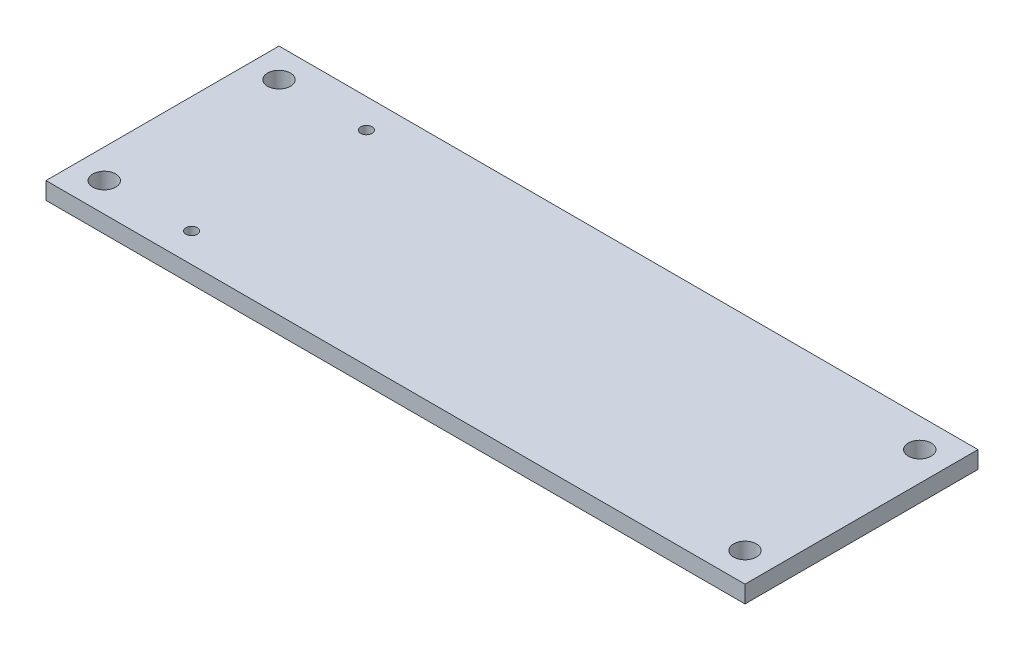
ISO-10303-21;
HEADER;
FILE_DESCRIPTION(('STEP AP214'),'2;1');
FILE_NAME('part.step','',(''),(''),'','','');
FILE_SCHEMA(('AUTOMOTIVE_DESIGN { 1 0 10303 214 1 1 1 1 }'));
ENDSEC;
DATA;
#1=APPLICATION_CONTEXT('core data for automotive mechanical design processes');
#2=APPLICATION_PROTOCOL_DEFINITION('international standard','automotive_design',2000,#1);
#3=PRODUCT_CONTEXT('',#1,'mechanical');
#4=PRODUCT('Part','Part','',(#3));
#5=PRODUCT_RELATED_PRODUCT_CATEGORY('part','',(#4));
#6=PRODUCT_DEFINITION_FORMATION('','',#4);
#7=PRODUCT_DEFINITION_CONTEXT('part definition',#1,'design');
#8=PRODUCT_DEFINITION('design','',#6,#7);
#9=PRODUCT_DEFINITION_SHAPE('','',#8);
#10=(LENGTH_UNIT() NAMED_UNIT(*) SI_UNIT(.MILLI.,.METRE.));
#11=(NAMED_UNIT(*) PLANE_ANGLE_UNIT() SI_UNIT($,.RADIAN.));
#12=(NAMED_UNIT(*) SI_UNIT($,.STERADIAN.) SOLID_ANGLE_UNIT());
#13=UNCERTAINTY_MEASURE_WITH_UNIT(LENGTH_MEASURE(1.E-05),#10,'distance_accuracy_value','');
#14=(GEOMETRIC_REPRESENTATION_CONTEXT(3) GLOBAL_UNCERTAINTY_ASSIGNED_CONTEXT((#13)) GLOBAL_UNIT_ASSIGNED_CONTEXT((#10,
#11,#12)) REPRESENTATION_CONTEXT('',''));
#15=CARTESIAN_POINT('',(0.,0.,0.));
#16=DIRECTION('',(0.,0.,1.));
#17=DIRECTION('',(1.,0.,0.));
#18=AXIS2_PLACEMENT_3D('',#15,#16,#17);
#19=CARTESIAN_POINT('',(0.,0.,0.));
#20=DIRECTION('',(0.,1.,0.));
#21=DIRECTION('',(0.,0.,1.));
#22=AXIS2_PLACEMENT_3D('',#19,#20,#21);
#23=PLANE('',#22);
#24=CARTESIAN_POINT('',(2.54,0.,-17.78));
#25=DIRECTION('',(0.,1.,0.));
#26=DIRECTION('',(0.,0.,1.));
#27=AXIS2_PLACEMENT_3D('',#24,#25,#26);
#28=CIRCLE('',#27,0.999999999999999);
#29=CARTESIAN_POINT('',(2.54,0.,-16.78));
#30=VERTEX_POINT('',#29);
#31=EDGE_CURVE('E160',#30,#30,#28,.F.);
#32=ORIENTED_EDGE('',*,*,#31,.F.);
#33=EDGE_LOOP('',(#32));
#34=FACE_BOUND('',#33,.T.);
#35=CARTESIAN_POINT('',(58.42,0.,-17.78));
#36=DIRECTION('',(0.,1.,0.));
#37=DIRECTION('',(0.,0.,1.));
#38=AXIS2_PLACEMENT_3D('',#35,#36,#37);
#39=CIRCLE('',#38,0.999999999999997);
#40=CARTESIAN_POINT('',(58.42,0.,-16.78));
#41=VERTEX_POINT('',#40);
#42=EDGE_CURVE('E157',#41,#41,#39,.T.);
#43=ORIENTED_EDGE('',*,*,#42,.T.);
#44=EDGE_LOOP('',(#43));
#45=FACE_BOUND('',#44,.T.);
#46=DIRECTION('',(1.,0.,0.));
#47=VECTOR('',#46,1.);
#48=CARTESIAN_POINT('',(0.,0.,0.));
#49=LINE('',#48,#47);
#50=CARTESIAN_POINT('',(0.,0.,0.));
#51=VERTEX_POINT('',#50);
#52=CARTESIAN_POINT('',(60.96,0.,0.));
#53=VERTEX_POINT('',#52);
#54=EDGE_CURVE('E149',#51,#53,#49,.T.);
#55=ORIENTED_EDGE('',*,*,#54,.F.);
#56=DIRECTION('',(0.,0.,-1.));
#57=VECTOR('',#56,1.);
#58=CARTESIAN_POINT('',(0.,0.,0.));
#59=LINE('',#58,#57);
#60=CARTESIAN_POINT('',(0.,0.,-20.32));
#61=VERTEX_POINT('',#60);
#62=EDGE_CURVE('E154',#51,#61,#59,.T.);
#63=ORIENTED_EDGE('',*,*,#62,.T.);
#64=DIRECTION('',(1.,0.,0.));
#65=VECTOR('',#64,1.);
#66=CARTESIAN_POINT('',(0.,0.,-20.32));
#67=LINE('',#66,#65);
#68=CARTESIAN_POINT('',(60.96,0.,-20.32));
#69=VERTEX_POINT('',#68);
#70=EDGE_CURVE('E152',#61,#69,#67,.T.);
#71=ORIENTED_EDGE('',*,*,#70,.T.);
#72=DIRECTION('',(0.,0.,-1.));
#73=VECTOR('',#72,1.);
#74=CARTESIAN_POINT('',(60.96,0.,0.));
#75=LINE('',#74,#73);
#76=EDGE_CURVE('E121',#53,#69,#75,.T.);
#77=ORIENTED_EDGE('',*,*,#76,.F.);
#78=EDGE_LOOP('',(#55,#63,#71,#77));
#79=FACE_BOUND('',#78,.T.);
#80=CARTESIAN_POINT('',(2.54,0.,-2.54));
#81=DIRECTION('',(0.,1.,0.));
#82=DIRECTION('',(0.,0.,1.));
#83=AXIS2_PLACEMENT_3D('',#80,#81,#82);
#84=CIRCLE('',#83,1.);
#85=CARTESIAN_POINT('',(2.54,0.,-1.54));
#86=VERTEX_POINT('',#85);
#87=EDGE_CURVE('E146',#86,#86,#84,.T.);
#88=ORIENTED_EDGE('',*,*,#87,.T.);
#89=EDGE_LOOP('',(#88));
#90=FACE_BOUND('',#89,.T.);
#91=CARTESIAN_POINT('',(58.42,0.,-2.54));
#92=DIRECTION('',(0.,1.,0.));
#93=DIRECTION('',(0.,0.,1.));
#94=AXIS2_PLACEMENT_3D('',#91,#92,#93);
#95=CIRCLE('',#94,0.999999999999998);
#96=CARTESIAN_POINT('',(58.42,0.,-1.54));
#97=VERTEX_POINT('',#96);
#98=EDGE_CURVE('E143',#97,#97,#95,.F.);
#99=ORIENTED_EDGE('',*,*,#98,.F.);
#100=EDGE_LOOP('',(#99));
#101=FACE_BOUND('',#100,.T.);
#102=CARTESIAN_POINT('',(10.16,0.,-2.54));
#103=DIRECTION('',(0.,1.,0.));
#104=DIRECTION('',(0.,0.,1.));
#105=AXIS2_PLACEMENT_3D('',#102,#103,#104);
#106=CIRCLE('',#105,0.500000000000001);
#107=CARTESIAN_POINT('',(10.16,0.,-2.04));
#108=VERTEX_POINT('',#107);
#109=EDGE_CURVE('E139',#108,#108,#106,.T.);
#110=ORIENTED_EDGE('',*,*,#109,.T.);
#111=EDGE_LOOP('',(#110));
#112=FACE_BOUND('',#111,.T.);
#113=CARTESIAN_POINT('',(10.16,0.,-17.78));
#114=DIRECTION('',(0.,1.,0.));
#115=DIRECTION('',(0.,0.,1.));
#116=AXIS2_PLACEMENT_3D('',#113,#114,#115);
#117=CIRCLE('',#116,0.500000000000001);
#118=CARTESIAN_POINT('',(10.16,0.,-17.28));
#119=VERTEX_POINT('',#118);
#120=EDGE_CURVE('E136',#119,#119,#117,.F.);
#121=ORIENTED_EDGE('',*,*,#120,.F.);
#122=EDGE_LOOP('',(#121));
#123=FACE_BOUND('',#122,.T.);
#124=CARTESIAN_POINT('',(55.88,0.,-11.11));
#125=DIRECTION('',(0.,-1.,0.));
#126=DIRECTION('',(0.,0.,-1.));
#127=AXIS2_PLACEMENT_3D('',#124,#125,#126);
#128=CIRCLE('',#127,0.499999999999999);
#129=CARTESIAN_POINT('',(55.88,0.,-11.61));
#130=VERTEX_POINT('',#129);
#131=EDGE_CURVE('E176',#130,#130,#128,.T.);
#132=ORIENTED_EDGE('',*,*,#131,.F.);
#133=EDGE_LOOP('',(#132));
#134=FACE_BOUND('',#133,.T.);
#135=CARTESIAN_POINT('',(55.88,0.,-8.57));
#136=DIRECTION('',(0.,1.,0.));
#137=DIRECTION('',(0.,0.,1.));
#138=AXIS2_PLACEMENT_3D('',#135,#136,#137);
#139=CIRCLE('',#138,0.499999999999999);
#140=CARTESIAN_POINT('',(55.88,0.,-8.07));
#141=VERTEX_POINT('',#140);
#142=EDGE_CURVE('E247',#141,#141,#139,.T.);
#143=ORIENTED_EDGE('',*,*,#142,.T.);
#144=EDGE_LOOP('',(#143));
#145=FACE_BOUND('',#144,.T.);
#146=ADVANCED_FACE('F65',(#34,#45,#79,#90,#101,#112,#123,#134,#145),#23,.F.);
#147=CARTESIAN_POINT('',(2.54,1.5,-17.78));
#148=DIRECTION('',(0.,-1.,0.));
#149=DIRECTION('',(0.,0.,-1.));
#150=AXIS2_PLACEMENT_3D('',#147,#148,#149);
#151=CYLINDRICAL_SURFACE('',#150,0.999999999999999);
#152=CARTESIAN_POINT('',(2.54,1.5,-17.78));
#153=DIRECTION('',(0.,1.,0.));
#154=DIRECTION('',(0.,0.,1.));
#155=AXIS2_PLACEMENT_3D('',#152,#153,#154);
#156=CIRCLE('',#155,0.999999999999999);
#157=CARTESIAN_POINT('',(2.54,1.5,-16.78));
#158=VERTEX_POINT('',#157);
#159=EDGE_CURVE('E133',#158,#158,#156,.F.);
#160=ORIENTED_EDGE('',*,*,#159,.F.);
#161=EDGE_LOOP('',(#160));
#162=FACE_BOUND('',#161,.T.);
#163=ORIENTED_EDGE('',*,*,#31,.T.);
#164=EDGE_LOOP('',(#163));
#165=FACE_BOUND('',#164,.T.);
#166=ADVANCED_FACE('F203',(#162,#165),#151,.F.);
#167=CARTESIAN_POINT('',(58.42,1.5,-17.78));
#168=DIRECTION('',(0.,-1.,0.));
#169=DIRECTION('',(0.,0.,-1.));
#170=AXIS2_PLACEMENT_3D('',#167,#168,#169);
#171=CYLINDRICAL_SURFACE('',#170,0.999999999999997);
#172=CARTESIAN_POINT('',(58.42,1.5,-17.78));
#173=DIRECTION('',(0.,1.,0.));
#174=DIRECTION('',(0.,0.,1.));
#175=AXIS2_PLACEMENT_3D('',#172,#173,#174);
#176=CIRCLE('',#175,0.999999999999997);
#177=CARTESIAN_POINT('',(58.42,1.5,-16.78));
#178=VERTEX_POINT('',#177);
#179=EDGE_CURVE('E127',#178,#178,#176,.T.);
#180=ORIENTED_EDGE('',*,*,#179,.T.);
#181=EDGE_LOOP('',(#180));
#182=FACE_BOUND('',#181,.T.);
#183=ORIENTED_EDGE('',*,*,#42,.F.);
#184=EDGE_LOOP('',(#183));
#185=FACE_BOUND('',#184,.T.);
#186=ADVANCED_FACE('F208',(#182,#185),#171,.F.);
#187=CARTESIAN_POINT('',(60.96,1.5,0.));
#188=DIRECTION('',(-1.,0.,0.));
#189=DIRECTION('',(0.,0.,1.));
#190=AXIS2_PLACEMENT_3D('',#187,#188,#189);
#191=PLANE('',#190);
#192=ORIENTED_EDGE('',*,*,#76,.T.);
#193=DIRECTION('',(0.,-1.,0.));
#194=VECTOR('',#193,1.);
#195=CARTESIAN_POINT('',(60.96,1.5,-20.32));
#196=LINE('',#195,#194);
#197=CARTESIAN_POINT('',(60.96,1.5,-20.32));
#198=VERTEX_POINT('',#197);
#199=EDGE_CURVE('E74',#198,#69,#196,.T.);
#200=ORIENTED_EDGE('',*,*,#199,.F.);
#201=DIRECTION('',(0.,0.,-1.));
#202=VECTOR('',#201,1.);
#203=CARTESIAN_POINT('',(60.96,1.5,0.));
#204=LINE('',#203,#202);
#205=CARTESIAN_POINT('',(60.96,1.5,0.));
#206=VERTEX_POINT('',#205);
#207=EDGE_CURVE('E107',#206,#198,#204,.T.);
#208=ORIENTED_EDGE('',*,*,#207,.F.);
#209=DIRECTION('',(0.,-1.,0.));
#210=VECTOR('',#209,1.);
#211=CARTESIAN_POINT('',(60.96,1.5,0.));
#212=LINE('',#211,#210);
#213=EDGE_CURVE('E12',#206,#53,#212,.T.);
#214=ORIENTED_EDGE('',*,*,#213,.T.);
#215=EDGE_LOOP('',(#192,#200,#208,#214));
#216=FACE_BOUND('',#215,.T.);
#217=ADVANCED_FACE('F120',(#216),#191,.F.);
#218=CARTESIAN_POINT('',(0.,1.5,-20.32));
#219=DIRECTION('',(0.,0.,-1.));
#220=DIRECTION('',(-1.,0.,0.));
#221=AXIS2_PLACEMENT_3D('',#218,#219,#220);
#222=PLANE('',#221);
#223=ORIENTED_EDGE('',*,*,#70,.F.);
#224=DIRECTION('',(0.,-1.,0.));
#225=VECTOR('',#224,1.);
#226=CARTESIAN_POINT('',(0.,1.5,-20.32));
#227=LINE('',#226,#225);
#228=CARTESIAN_POINT('',(0.,1.5,-20.32));
#229=VERTEX_POINT('',#228);
#230=EDGE_CURVE('E96',#229,#61,#227,.T.);
#231=ORIENTED_EDGE('',*,*,#230,.F.);
#232=DIRECTION('',(1.,0.,0.));
#233=VECTOR('',#232,1.);
#234=CARTESIAN_POINT('',(0.,1.5,-20.32));
#235=LINE('',#234,#233);
#236=EDGE_CURVE('E115',#229,#198,#235,.T.);
#237=ORIENTED_EDGE('',*,*,#236,.T.);
#238=ORIENTED_EDGE('',*,*,#199,.T.);
#239=EDGE_LOOP('',(#223,#231,#237,#238));
#240=FACE_BOUND('',#239,.T.);
#241=ADVANCED_FACE('F124',(#240),#222,.T.);
#242=CARTESIAN_POINT('',(0.,1.5,0.));
#243=DIRECTION('',(-1.,0.,0.));
#244=DIRECTION('',(0.,0.,1.));
#245=AXIS2_PLACEMENT_3D('',#242,#243,#244);
#246=PLANE('',#245);
#247=ORIENTED_EDGE('',*,*,#62,.F.);
#248=DIRECTION('',(0.,-1.,0.));
#249=VECTOR('',#248,1.);
#250=CARTESIAN_POINT('',(0.,1.5,0.));
#251=LINE('',#250,#249);
#252=CARTESIAN_POINT('',(0.,1.5,0.));
#253=VERTEX_POINT('',#252);
#254=EDGE_CURVE('E82',#253,#51,#251,.T.);
#255=ORIENTED_EDGE('',*,*,#254,.F.);
#256=DIRECTION('',(0.,0.,-1.));
#257=VECTOR('',#256,1.);
#258=CARTESIAN_POINT('',(0.,1.5,0.));
#259=LINE('',#258,#257);
#260=EDGE_CURVE('E125',#253,#229,#259,.T.);
#261=ORIENTED_EDGE('',*,*,#260,.T.);
#262=ORIENTED_EDGE('',*,*,#230,.T.);
#263=EDGE_LOOP('',(#247,#255,#261,#262));
#264=FACE_BOUND('',#263,.T.);
#265=ADVANCED_FACE('F216',(#264),#246,.T.);
#266=CARTESIAN_POINT('',(0.,1.5,0.));
#267=DIRECTION('',(0.,0.,-1.));
#268=DIRECTION('',(-1.,0.,0.));
#269=AXIS2_PLACEMENT_3D('',#266,#267,#268);
#270=PLANE('',#269);
#271=ORIENTED_EDGE('',*,*,#54,.T.);
#272=ORIENTED_EDGE('',*,*,#213,.F.);
#273=DIRECTION('',(1.,0.,0.));
#274=VECTOR('',#273,1.);
#275=CARTESIAN_POINT('',(0.,1.5,0.));
#276=LINE('',#275,#274);
#277=EDGE_CURVE('E116',#253,#206,#276,.T.);
#278=ORIENTED_EDGE('',*,*,#277,.F.);
#279=ORIENTED_EDGE('',*,*,#254,.T.);
#280=EDGE_LOOP('',(#271,#272,#278,#279));
#281=FACE_BOUND('',#280,.T.);
#282=ADVANCED_FACE('F219',(#281),#270,.F.);
#283=CARTESIAN_POINT('',(2.54,1.5,-2.54));
#284=DIRECTION('',(0.,-1.,0.));
#285=DIRECTION('',(0.,0.,-1.));
#286=AXIS2_PLACEMENT_3D('',#283,#284,#285);
#287=CYLINDRICAL_SURFACE('',#286,1.);
#288=CARTESIAN_POINT('',(2.54,1.5,-2.54));
#289=DIRECTION('',(0.,1.,0.));
#290=DIRECTION('',(0.,0.,1.));
#291=AXIS2_PLACEMENT_3D('',#288,#289,#290);
#292=CIRCLE('',#291,1.);
#293=CARTESIAN_POINT('',(2.54,1.5,-1.54));
#294=VERTEX_POINT('',#293);
#295=EDGE_CURVE('E181',#294,#294,#292,.T.);
#296=ORIENTED_EDGE('',*,*,#295,.T.);
#297=EDGE_LOOP('',(#296));
#298=FACE_BOUND('',#297,.T.);
#299=ORIENTED_EDGE('',*,*,#87,.F.);
#300=EDGE_LOOP('',(#299));
#301=FACE_BOUND('',#300,.T.);
#302=ADVANCED_FACE('F185',(#298,#301),#287,.F.);
#303=CARTESIAN_POINT('',(58.42,1.5,-2.54));
#304=DIRECTION('',(0.,-1.,0.));
#305=DIRECTION('',(0.,0.,-1.));
#306=AXIS2_PLACEMENT_3D('',#303,#304,#305);
#307=CYLINDRICAL_SURFACE('',#306,0.999999999999998);
#308=CARTESIAN_POINT('',(58.42,1.5,-2.54));
#309=DIRECTION('',(0.,1.,0.));
#310=DIRECTION('',(0.,0.,1.));
#311=AXIS2_PLACEMENT_3D('',#308,#309,#310);
#312=CIRCLE('',#311,0.999999999999998);
#313=CARTESIAN_POINT('',(58.42,1.5,-1.54));
#314=VERTEX_POINT('',#313);
#315=EDGE_CURVE('E173',#314,#314,#312,.F.);
#316=ORIENTED_EDGE('',*,*,#315,.F.);
#317=EDGE_LOOP('',(#316));
#318=FACE_BOUND('',#317,.T.);
#319=ORIENTED_EDGE('',*,*,#98,.T.);
#320=EDGE_LOOP('',(#319));
#321=FACE_BOUND('',#320,.T.);
#322=ADVANCED_FACE('F228',(#318,#321),#307,.F.);
#323=CARTESIAN_POINT('',(10.16,1.5,-2.54));
#324=DIRECTION('',(0.,-1.,0.));
#325=DIRECTION('',(0.,0.,-1.));
#326=AXIS2_PLACEMENT_3D('',#323,#324,#325);
#327=CYLINDRICAL_SURFACE('',#326,0.500000000000001);
#328=CARTESIAN_POINT('',(10.16,1.5,-2.54));
#329=DIRECTION('',(0.,1.,0.));
#330=DIRECTION('',(0.,0.,1.));
#331=AXIS2_PLACEMENT_3D('',#328,#329,#330);
#332=CIRCLE('',#331,0.500000000000001);
#333=CARTESIAN_POINT('',(10.16,1.5,-2.04));
#334=VERTEX_POINT('',#333);
#335=EDGE_CURVE('E168',#334,#334,#332,.T.);
#336=ORIENTED_EDGE('',*,*,#335,.T.);
#337=EDGE_LOOP('',(#336));
#338=FACE_BOUND('',#337,.T.);
#339=ORIENTED_EDGE('',*,*,#109,.F.);
#340=EDGE_LOOP('',(#339));
#341=FACE_BOUND('',#340,.T.);
#342=ADVANCED_FACE('F198',(#338,#341),#327,.F.);
#343=CARTESIAN_POINT('',(10.16,1.5,-17.78));
#344=DIRECTION('',(0.,-1.,0.));
#345=DIRECTION('',(0.,0.,-1.));
#346=AXIS2_PLACEMENT_3D('',#343,#344,#345);
#347=CYLINDRICAL_SURFACE('',#346,0.500000000000001);
#348=CARTESIAN_POINT('',(10.16,1.5,-17.78));
#349=DIRECTION('',(0.,1.,0.));
#350=DIRECTION('',(0.,0.,1.));
#351=AXIS2_PLACEMENT_3D('',#348,#349,#350);
#352=CIRCLE('',#351,0.500000000000001);
#353=CARTESIAN_POINT('',(10.16,1.5,-17.28));
#354=VERTEX_POINT('',#353);
#355=EDGE_CURVE('E163',#354,#354,#352,.F.);
#356=ORIENTED_EDGE('',*,*,#355,.F.);
#357=EDGE_LOOP('',(#356));
#358=FACE_BOUND('',#357,.T.);
#359=ORIENTED_EDGE('',*,*,#120,.T.);
#360=EDGE_LOOP('',(#359));
#361=FACE_BOUND('',#360,.T.);
#362=ADVANCED_FACE('F67',(#358,#361),#347,.F.);
#363=CARTESIAN_POINT('',(0.,1.5,0.));
#364=DIRECTION('',(0.,1.,0.));
#365=DIRECTION('',(0.,0.,1.));
#366=AXIS2_PLACEMENT_3D('',#363,#364,#365);
#367=PLANE('',#366);
#368=ORIENTED_EDGE('',*,*,#355,.T.);
#369=EDGE_LOOP('',(#368));
#370=FACE_BOUND('',#369,.T.);
#371=ORIENTED_EDGE('',*,*,#335,.F.);
#372=EDGE_LOOP('',(#371));
#373=FACE_BOUND('',#372,.T.);
#374=ORIENTED_EDGE('',*,*,#315,.T.);
#375=EDGE_LOOP('',(#374));
#376=FACE_BOUND('',#375,.T.);
#377=ORIENTED_EDGE('',*,*,#295,.F.);
#378=EDGE_LOOP('',(#377));
#379=FACE_BOUND('',#378,.T.);
#380=ORIENTED_EDGE('',*,*,#277,.T.);
#381=ORIENTED_EDGE('',*,*,#207,.T.);
#382=ORIENTED_EDGE('',*,*,#236,.F.);
#383=ORIENTED_EDGE('',*,*,#260,.F.);
#384=EDGE_LOOP('',(#380,#381,#382,#383));
#385=FACE_BOUND('',#384,.T.);
#386=ORIENTED_EDGE('',*,*,#179,.F.);
#387=EDGE_LOOP('',(#386));
#388=FACE_BOUND('',#387,.T.);
#389=ORIENTED_EDGE('',*,*,#159,.T.);
#390=EDGE_LOOP('',(#389));
#391=FACE_BOUND('',#390,.T.);
#392=ADVANCED_FACE('F111',(#370,#373,#376,#379,#385,#388,#391),#367,.T.);
#393=CARTESIAN_POINT('',(55.88,0.03,-11.11));
#394=DIRECTION('',(0.,-1.,0.));
#395=DIRECTION('',(0.,0.,-1.));
#396=AXIS2_PLACEMENT_3D('',#393,#394,#395);
#397=CYLINDRICAL_SURFACE('',#396,0.499999999999999);
#398=CARTESIAN_POINT('',(55.88,0.03,-11.11));
#399=DIRECTION('',(0.,-1.,0.));
#400=DIRECTION('',(0.,0.,-1.));
#401=AXIS2_PLACEMENT_3D('',#398,#399,#400);
#402=CIRCLE('',#401,0.499999999999999);
#403=CARTESIAN_POINT('',(55.88,0.03,-11.61));
#404=VERTEX_POINT('',#403);
#405=EDGE_CURVE('E140',#404,#404,#402,.T.);
#406=ORIENTED_EDGE('',*,*,#405,.F.);
#407=EDGE_LOOP('',(#406));
#408=FACE_BOUND('',#407,.T.);
#409=ORIENTED_EDGE('',*,*,#131,.T.);
#410=EDGE_LOOP('',(#409));
#411=FACE_BOUND('',#410,.T.);
#412=ADVANCED_FACE('F189',(#408,#411),#397,.F.);
#413=CARTESIAN_POINT('',(55.88,0.03,-11.11));
#414=DIRECTION('',(0.,-1.,0.));
#415=DIRECTION('',(0.,0.,-1.));
#416=AXIS2_PLACEMENT_3D('',#413,#414,#415);
#417=PLANE('',#416);
#418=ORIENTED_EDGE('',*,*,#405,.T.);
#419=EDGE_LOOP('',(#418));
#420=FACE_BOUND('',#419,.T.);
#421=ADVANCED_FACE('F195',(#420),#417,.T.);
#422=CARTESIAN_POINT('',(55.88,0.03,-8.57));
#423=DIRECTION('',(0.,-1.,0.));
#424=DIRECTION('',(0.,0.,-1.));
#425=AXIS2_PLACEMENT_3D('',#422,#423,#424);
#426=CYLINDRICAL_SURFACE('',#425,0.499999999999999);
#427=CARTESIAN_POINT('',(55.88,0.03,-8.57));
#428=DIRECTION('',(0.,1.,0.));
#429=DIRECTION('',(0.,0.,1.));
#430=AXIS2_PLACEMENT_3D('',#427,#428,#429);
#431=CIRCLE('',#430,0.499999999999999);
#432=CARTESIAN_POINT('',(55.88,0.03,-8.07));
#433=VERTEX_POINT('',#432);
#434=EDGE_CURVE('E249',#433,#433,#431,.T.);
#435=ORIENTED_EDGE('',*,*,#434,.T.);
#436=EDGE_LOOP('',(#435));
#437=FACE_BOUND('',#436,.T.);
#438=ORIENTED_EDGE('',*,*,#142,.F.);
#439=EDGE_LOOP('',(#438));
#440=FACE_BOUND('',#439,.T.);
#441=ADVANCED_FACE('F258',(#437,#440),#426,.F.);
#442=CARTESIAN_POINT('',(55.88,0.03,-8.57));
#443=DIRECTION('',(0.,1.,0.));
#444=DIRECTION('',(0.,0.,1.));
#445=AXIS2_PLACEMENT_3D('',#442,#443,#444);
#446=PLANE('',#445);
#447=ORIENTED_EDGE('',*,*,#434,.F.);
#448=EDGE_LOOP('',(#447));
#449=FACE_BOUND('',#448,.T.);
#450=ADVANCED_FACE('F263',(#449),#446,.F.);
#451=CLOSED_SHELL('',(#146,#166,#186,#217,#241,#265,#282,#302,#322,#342,#362,#392,#412,#421,
#441,#450));
#452=MANIFOLD_SOLID_BREP('B2',#451);
#453=ADVANCED_BREP_SHAPE_REPRESENTATION('',(#18,#452),#14);
#454=SHAPE_DEFINITION_REPRESENTATION(#9,#453);
ENDSEC;
END-ISO-10303-21;
